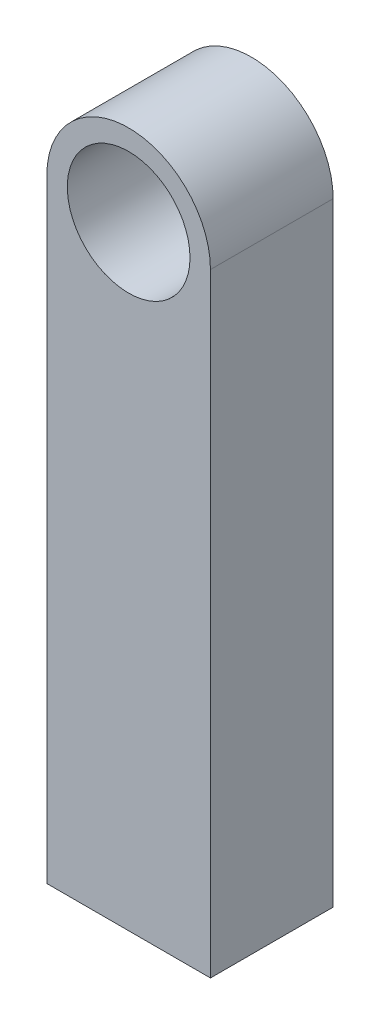
ISO-10303-21;
HEADER;
FILE_DESCRIPTION(('STEP AP214'),'2;1');
FILE_NAME('part.step','',(''),(''),'','','');
FILE_SCHEMA(('AUTOMOTIVE_DESIGN { 1 0 10303 214 1 1 1 1 }'));
ENDSEC;
DATA;
#1=APPLICATION_CONTEXT('core data for automotive mechanical design processes');
#2=APPLICATION_PROTOCOL_DEFINITION('international standard','automotive_design',2000,#1);
#3=PRODUCT_CONTEXT('',#1,'mechanical');
#4=PRODUCT('Part','Part','',(#3));
#5=PRODUCT_RELATED_PRODUCT_CATEGORY('part','',(#4));
#6=PRODUCT_DEFINITION_FORMATION('','',#4);
#7=PRODUCT_DEFINITION_CONTEXT('part definition',#1,'design');
#8=PRODUCT_DEFINITION('design','',#6,#7);
#9=PRODUCT_DEFINITION_SHAPE('','',#8);
#10=(LENGTH_UNIT() NAMED_UNIT(*) SI_UNIT(.MILLI.,.METRE.));
#11=(NAMED_UNIT(*) PLANE_ANGLE_UNIT() SI_UNIT($,.RADIAN.));
#12=(NAMED_UNIT(*) SI_UNIT($,.STERADIAN.) SOLID_ANGLE_UNIT());
#13=UNCERTAINTY_MEASURE_WITH_UNIT(LENGTH_MEASURE(1.E-05),#10,'distance_accuracy_value','');
#14=(GEOMETRIC_REPRESENTATION_CONTEXT(3) GLOBAL_UNCERTAINTY_ASSIGNED_CONTEXT((#13)) GLOBAL_UNIT_ASSIGNED_CONTEXT((#10,
#11,#12)) REPRESENTATION_CONTEXT('',''));
#15=CARTESIAN_POINT('',(0.,0.,0.));
#16=DIRECTION('',(0.,0.,1.));
#17=DIRECTION('',(1.,0.,0.));
#18=AXIS2_PLACEMENT_3D('',#15,#16,#17);
#19=CARTESIAN_POINT('',(2.,0.,3.));
#20=DIRECTION('',(1.,0.,0.));
#21=DIRECTION('',(0.,1.,0.));
#22=AXIS2_PLACEMENT_3D('',#19,#20,#21);
#23=PLANE('',#22);
#24=DIRECTION('',(0.,-1.,0.));
#25=VECTOR('',#24,1.);
#26=CARTESIAN_POINT('',(2.,0.,0.));
#27=LINE('',#26,#25);
#28=CARTESIAN_POINT('',(2.,0.,0.));
#29=VERTEX_POINT('',#28);
#30=CARTESIAN_POINT('',(2.,-15.,0.));
#31=VERTEX_POINT('',#30);
#32=EDGE_CURVE('E143',#29,#31,#27,.T.);
#33=ORIENTED_EDGE('',*,*,#32,.F.);
#34=DIRECTION('',(0.,0.,-1.));
#35=VECTOR('',#34,1.);
#36=CARTESIAN_POINT('',(2.,0.,3.));
#37=LINE('',#36,#35);
#38=CARTESIAN_POINT('',(2.,0.,3.));
#39=VERTEX_POINT('',#38);
#40=EDGE_CURVE('E11',#39,#29,#37,.T.);
#41=ORIENTED_EDGE('',*,*,#40,.F.);
#42=DIRECTION('',(0.,-1.,0.));
#43=VECTOR('',#42,1.);
#44=CARTESIAN_POINT('',(2.,0.,3.));
#45=LINE('',#44,#43);
#46=CARTESIAN_POINT('',(2.,-15.,3.));
#47=VERTEX_POINT('',#46);
#48=EDGE_CURVE('E147',#39,#47,#45,.T.);
#49=ORIENTED_EDGE('',*,*,#48,.T.);
#50=DIRECTION('',(0.,0.,-1.));
#51=VECTOR('',#50,1.);
#52=CARTESIAN_POINT('',(2.,-15.,3.));
#53=LINE('',#52,#51);
#54=EDGE_CURVE('E81',#47,#31,#53,.T.);
#55=ORIENTED_EDGE('',*,*,#54,.T.);
#56=EDGE_LOOP('',(#33,#41,#49,#55));
#57=FACE_BOUND('',#56,.T.);
#58=ADVANCED_FACE('F38',(#57),#23,.T.);
#59=CARTESIAN_POINT('',(0.,0.,3.));
#60=DIRECTION('',(0.,0.,-1.));
#61=DIRECTION('',(-1.,0.,0.));
#62=AXIS2_PLACEMENT_3D('',#59,#60,#61);
#63=CYLINDRICAL_SURFACE('',#62,2.);
#64=CARTESIAN_POINT('',(0.,0.,0.));
#65=DIRECTION('',(0.,0.,1.));
#66=DIRECTION('',(1.,0.,0.));
#67=AXIS2_PLACEMENT_3D('',#64,#65,#66);
#68=CIRCLE('',#67,2.);
#69=CARTESIAN_POINT('',(-2.,0.,0.));
#70=VERTEX_POINT('',#69);
#71=EDGE_CURVE('E160',#29,#70,#68,.T.);
#72=ORIENTED_EDGE('',*,*,#71,.T.);
#73=DIRECTION('',(0.,0.,-1.));
#74=VECTOR('',#73,1.);
#75=CARTESIAN_POINT('',(-2.,0.,3.));
#76=LINE('',#75,#74);
#77=CARTESIAN_POINT('',(-2.,0.,3.));
#78=VERTEX_POINT('',#77);
#79=EDGE_CURVE('E45',#78,#70,#76,.T.);
#80=ORIENTED_EDGE('',*,*,#79,.F.);
#81=CARTESIAN_POINT('',(0.,0.,3.));
#82=DIRECTION('',(0.,0.,1.));
#83=DIRECTION('',(1.,0.,0.));
#84=AXIS2_PLACEMENT_3D('',#81,#82,#83);
#85=CIRCLE('',#84,2.);
#86=EDGE_CURVE('E149',#39,#78,#85,.T.);
#87=ORIENTED_EDGE('',*,*,#86,.F.);
#88=ORIENTED_EDGE('',*,*,#40,.T.);
#89=EDGE_LOOP('',(#72,#80,#87,#88));
#90=FACE_BOUND('',#89,.T.);
#91=ADVANCED_FACE('F188',(#90),#63,.T.);
#92=CARTESIAN_POINT('',(-2.,0.,3.));
#93=DIRECTION('',(1.,0.,0.));
#94=DIRECTION('',(0.,1.,0.));
#95=AXIS2_PLACEMENT_3D('',#92,#93,#94);
#96=PLANE('',#95);
#97=DIRECTION('',(0.,-1.,0.));
#98=VECTOR('',#97,1.);
#99=CARTESIAN_POINT('',(-2.,0.,0.));
#100=LINE('',#99,#98);
#101=CARTESIAN_POINT('',(-2.,-15.,0.));
#102=VERTEX_POINT('',#101);
#103=EDGE_CURVE('E162',#70,#102,#100,.T.);
#104=ORIENTED_EDGE('',*,*,#103,.T.);
#105=DIRECTION('',(0.,0.,-1.));
#106=VECTOR('',#105,1.);
#107=CARTESIAN_POINT('',(-2.,-15.,3.));
#108=LINE('',#107,#106);
#109=CARTESIAN_POINT('',(-2.,-15.,3.));
#110=VERTEX_POINT('',#109);
#111=EDGE_CURVE('E169',#110,#102,#108,.T.);
#112=ORIENTED_EDGE('',*,*,#111,.F.);
#113=DIRECTION('',(0.,-1.,0.));
#114=VECTOR('',#113,1.);
#115=CARTESIAN_POINT('',(-2.,0.,3.));
#116=LINE('',#115,#114);
#117=EDGE_CURVE('E152',#78,#110,#116,.T.);
#118=ORIENTED_EDGE('',*,*,#117,.F.);
#119=ORIENTED_EDGE('',*,*,#79,.T.);
#120=EDGE_LOOP('',(#104,#112,#118,#119));
#121=FACE_BOUND('',#120,.T.);
#122=ADVANCED_FACE('F176',(#121),#96,.F.);
#123=CARTESIAN_POINT('',(0.,-15.,3.));
#124=DIRECTION('',(0.,1.,0.));
#125=DIRECTION('',(0.,0.,1.));
#126=AXIS2_PLACEMENT_3D('',#123,#124,#125);
#127=PLANE('',#126);
#128=DIRECTION('',(1.,0.,0.));
#129=VECTOR('',#128,1.);
#130=CARTESIAN_POINT('',(-1.5,-15.,0.5));
#131=LINE('',#130,#129);
#132=CARTESIAN_POINT('',(-1.5,-15.,0.5));
#133=VERTEX_POINT('',#132);
#134=CARTESIAN_POINT('',(1.5,-15.,0.5));
#135=VERTEX_POINT('',#134);
#136=EDGE_CURVE('E137',#133,#135,#131,.T.);
#137=ORIENTED_EDGE('',*,*,#136,.F.);
#138=DIRECTION('',(0.,0.,-1.));
#139=VECTOR('',#138,1.);
#140=CARTESIAN_POINT('',(-1.5,-15.,0.5));
#141=LINE('',#140,#139);
#142=CARTESIAN_POINT('',(-1.5,-15.,2.5));
#143=VERTEX_POINT('',#142);
#144=EDGE_CURVE('E52',#143,#133,#141,.T.);
#145=ORIENTED_EDGE('',*,*,#144,.F.);
#146=DIRECTION('',(-1.,0.,0.));
#147=VECTOR('',#146,1.);
#148=CARTESIAN_POINT('',(-1.5,-15.,2.5));
#149=LINE('',#148,#147);
#150=CARTESIAN_POINT('',(1.5,-15.,2.5));
#151=VERTEX_POINT('',#150);
#152=EDGE_CURVE('E128',#151,#143,#149,.T.);
#153=ORIENTED_EDGE('',*,*,#152,.F.);
#154=DIRECTION('',(0.,0.,1.));
#155=VECTOR('',#154,1.);
#156=CARTESIAN_POINT('',(1.5,-15.,0.5));
#157=LINE('',#156,#155);
#158=EDGE_CURVE('E131',#135,#151,#157,.T.);
#159=ORIENTED_EDGE('',*,*,#158,.F.);
#160=EDGE_LOOP('',(#137,#145,#153,#159));
#161=FACE_BOUND('',#160,.T.);
#162=DIRECTION('',(1.,0.,0.));
#163=VECTOR('',#162,1.);
#164=CARTESIAN_POINT('',(0.,-15.,0.));
#165=LINE('',#164,#163);
#166=EDGE_CURVE('E164',#102,#31,#165,.T.);
#167=ORIENTED_EDGE('',*,*,#166,.T.);
#168=ORIENTED_EDGE('',*,*,#54,.F.);
#169=DIRECTION('',(1.,0.,0.));
#170=VECTOR('',#169,1.);
#171=CARTESIAN_POINT('',(0.,-15.,3.));
#172=LINE('',#171,#170);
#173=EDGE_CURVE('E61',#110,#47,#172,.T.);
#174=ORIENTED_EDGE('',*,*,#173,.F.);
#175=ORIENTED_EDGE('',*,*,#111,.T.);
#176=EDGE_LOOP('',(#167,#168,#174,#175));
#177=FACE_BOUND('',#176,.T.);
#178=ADVANCED_FACE('F185',(#161,#177),#127,.F.);
#179=CARTESIAN_POINT('',(0.,0.,3.));
#180=DIRECTION('',(0.,0.,-1.));
#181=DIRECTION('',(-1.,0.,0.));
#182=AXIS2_PLACEMENT_3D('',#179,#180,#181);
#183=CYLINDRICAL_SURFACE('',#182,1.5);
#184=CARTESIAN_POINT('',(0.,0.,3.));
#185=DIRECTION('',(0.,0.,1.));
#186=DIRECTION('',(1.,0.,0.));
#187=AXIS2_PLACEMENT_3D('',#184,#185,#186);
#188=CIRCLE('',#187,1.5);
#189=CARTESIAN_POINT('',(1.5,0.,3.));
#190=VERTEX_POINT('',#189);
#191=EDGE_CURVE('E155',#190,#190,#188,.T.);
#192=ORIENTED_EDGE('',*,*,#191,.T.);
#193=EDGE_LOOP('',(#192));
#194=FACE_BOUND('',#193,.T.);
#195=CARTESIAN_POINT('',(0.,0.,0.));
#196=DIRECTION('',(0.,0.,1.));
#197=DIRECTION('',(1.,0.,0.));
#198=AXIS2_PLACEMENT_3D('',#195,#196,#197);
#199=CIRCLE('',#198,1.5);
#200=CARTESIAN_POINT('',(1.5,0.,0.));
#201=VERTEX_POINT('',#200);
#202=EDGE_CURVE('E150',#201,#201,#199,.T.);
#203=ORIENTED_EDGE('',*,*,#202,.F.);
#204=EDGE_LOOP('',(#203));
#205=FACE_BOUND('',#204,.T.);
#206=ADVANCED_FACE('F198',(#194,#205),#183,.F.);
#207=CARTESIAN_POINT('',(0.,0.,3.));
#208=DIRECTION('',(0.,0.,1.));
#209=DIRECTION('',(1.,0.,0.));
#210=AXIS2_PLACEMENT_3D('',#207,#208,#209);
#211=PLANE('',#210);
#212=ORIENTED_EDGE('',*,*,#48,.F.);
#213=ORIENTED_EDGE('',*,*,#86,.T.);
#214=ORIENTED_EDGE('',*,*,#117,.T.);
#215=ORIENTED_EDGE('',*,*,#173,.T.);
#216=EDGE_LOOP('',(#212,#213,#214,#215));
#217=FACE_BOUND('',#216,.T.);
#218=ORIENTED_EDGE('',*,*,#191,.F.);
#219=EDGE_LOOP('',(#218));
#220=FACE_BOUND('',#219,.T.);
#221=ADVANCED_FACE('F186',(#217,#220),#211,.T.);
#222=CARTESIAN_POINT('',(0.,0.,0.));
#223=DIRECTION('',(0.,0.,1.));
#224=DIRECTION('',(1.,0.,0.));
#225=AXIS2_PLACEMENT_3D('',#222,#223,#224);
#226=PLANE('',#225);
#227=ORIENTED_EDGE('',*,*,#32,.T.);
#228=ORIENTED_EDGE('',*,*,#166,.F.);
#229=ORIENTED_EDGE('',*,*,#103,.F.);
#230=ORIENTED_EDGE('',*,*,#71,.F.);
#231=EDGE_LOOP('',(#227,#228,#229,#230));
#232=FACE_BOUND('',#231,.T.);
#233=ORIENTED_EDGE('',*,*,#202,.T.);
#234=EDGE_LOOP('',(#233));
#235=FACE_BOUND('',#234,.T.);
#236=ADVANCED_FACE('F182',(#232,#235),#226,.F.);
#237=CARTESIAN_POINT('',(-1.5,-5.,0.5));
#238=DIRECTION('',(-1.,0.,0.));
#239=DIRECTION('',(0.,0.,1.));
#240=AXIS2_PLACEMENT_3D('',#237,#238,#239);
#241=PLANE('',#240);
#242=ORIENTED_EDGE('',*,*,#144,.T.);
#243=DIRECTION('',(0.,-1.,0.));
#244=VECTOR('',#243,1.);
#245=CARTESIAN_POINT('',(-1.5,-5.,0.5));
#246=LINE('',#245,#244);
#247=CARTESIAN_POINT('',(-1.5,-5.,0.5));
#248=VERTEX_POINT('',#247);
#249=EDGE_CURVE('E106',#248,#133,#246,.T.);
#250=ORIENTED_EDGE('',*,*,#249,.F.);
#251=DIRECTION('',(0.,0.,-1.));
#252=VECTOR('',#251,1.);
#253=CARTESIAN_POINT('',(-1.5,-5.,0.5));
#254=LINE('',#253,#252);
#255=CARTESIAN_POINT('',(-1.5,-5.,2.5));
#256=VERTEX_POINT('',#255);
#257=EDGE_CURVE('E110',#256,#248,#254,.T.);
#258=ORIENTED_EDGE('',*,*,#257,.F.);
#259=DIRECTION('',(0.,-1.,0.));
#260=VECTOR('',#259,1.);
#261=CARTESIAN_POINT('',(-1.5,-5.,2.5));
#262=LINE('',#261,#260);
#263=EDGE_CURVE('E141',#256,#143,#262,.T.);
#264=ORIENTED_EDGE('',*,*,#263,.T.);
#265=EDGE_LOOP('',(#242,#250,#258,#264));
#266=FACE_BOUND('',#265,.T.);
#267=ADVANCED_FACE('F108',(#266),#241,.F.);
#268=CARTESIAN_POINT('',(-1.5,-5.,2.5));
#269=DIRECTION('',(0.,0.,1.));
#270=DIRECTION('',(1.,0.,0.));
#271=AXIS2_PLACEMENT_3D('',#268,#269,#270);
#272=PLANE('',#271);
#273=ORIENTED_EDGE('',*,*,#152,.T.);
#274=ORIENTED_EDGE('',*,*,#263,.F.);
#275=DIRECTION('',(-1.,0.,0.));
#276=VECTOR('',#275,1.);
#277=CARTESIAN_POINT('',(-1.5,-5.,2.5));
#278=LINE('',#277,#276);
#279=CARTESIAN_POINT('',(1.5,-5.,2.5));
#280=VERTEX_POINT('',#279);
#281=EDGE_CURVE('E116',#280,#256,#278,.T.);
#282=ORIENTED_EDGE('',*,*,#281,.F.);
#283=DIRECTION('',(0.,-1.,0.));
#284=VECTOR('',#283,1.);
#285=CARTESIAN_POINT('',(1.5,-5.,2.5));
#286=LINE('',#285,#284);
#287=EDGE_CURVE('E144',#280,#151,#286,.T.);
#288=ORIENTED_EDGE('',*,*,#287,.T.);
#289=EDGE_LOOP('',(#273,#274,#282,#288));
#290=FACE_BOUND('',#289,.T.);
#291=ADVANCED_FACE('F209',(#290),#272,.F.);
#292=CARTESIAN_POINT('',(1.5,-5.,0.5));
#293=DIRECTION('',(1.,0.,0.));
#294=DIRECTION('',(0.,0.,-1.));
#295=AXIS2_PLACEMENT_3D('',#292,#293,#294);
#296=PLANE('',#295);
#297=ORIENTED_EDGE('',*,*,#158,.T.);
#298=ORIENTED_EDGE('',*,*,#287,.F.);
#299=DIRECTION('',(0.,0.,1.));
#300=VECTOR('',#299,1.);
#301=CARTESIAN_POINT('',(1.5,-5.,0.5));
#302=LINE('',#301,#300);
#303=CARTESIAN_POINT('',(1.5,-5.,0.5));
#304=VERTEX_POINT('',#303);
#305=EDGE_CURVE('E124',#304,#280,#302,.T.);
#306=ORIENTED_EDGE('',*,*,#305,.F.);
#307=DIRECTION('',(0.,-1.,0.));
#308=VECTOR('',#307,1.);
#309=CARTESIAN_POINT('',(1.5,-5.,0.5));
#310=LINE('',#309,#308);
#311=EDGE_CURVE('E115',#304,#135,#310,.T.);
#312=ORIENTED_EDGE('',*,*,#311,.T.);
#313=EDGE_LOOP('',(#297,#298,#306,#312));
#314=FACE_BOUND('',#313,.T.);
#315=ADVANCED_FACE('F212',(#314),#296,.F.);
#316=CARTESIAN_POINT('',(-1.5,-5.,0.5));
#317=DIRECTION('',(0.,0.,-1.));
#318=DIRECTION('',(-1.,0.,0.));
#319=AXIS2_PLACEMENT_3D('',#316,#317,#318);
#320=PLANE('',#319);
#321=ORIENTED_EDGE('',*,*,#136,.T.);
#322=ORIENTED_EDGE('',*,*,#311,.F.);
#323=DIRECTION('',(1.,0.,0.));
#324=VECTOR('',#323,1.);
#325=CARTESIAN_POINT('',(-1.5,-5.,0.5));
#326=LINE('',#325,#324);
#327=EDGE_CURVE('E119',#248,#304,#326,.T.);
#328=ORIENTED_EDGE('',*,*,#327,.F.);
#329=ORIENTED_EDGE('',*,*,#249,.T.);
#330=EDGE_LOOP('',(#321,#322,#328,#329));
#331=FACE_BOUND('',#330,.T.);
#332=ADVANCED_FACE('F120',(#331),#320,.F.);
#333=CARTESIAN_POINT('',(0.,-5.,0.));
#334=DIRECTION('',(0.,1.,0.));
#335=DIRECTION('',(0.,0.,1.));
#336=AXIS2_PLACEMENT_3D('',#333,#334,#335);
#337=PLANE('',#336);
#338=ORIENTED_EDGE('',*,*,#257,.T.);
#339=ORIENTED_EDGE('',*,*,#327,.T.);
#340=ORIENTED_EDGE('',*,*,#305,.T.);
#341=ORIENTED_EDGE('',*,*,#281,.T.);
#342=EDGE_LOOP('',(#338,#339,#340,#341));
#343=FACE_BOUND('',#342,.T.);
#344=ADVANCED_FACE('F126',(#343),#337,.F.);
#345=CLOSED_SHELL('',(#58,#91,#122,#178,#206,#221,#236,#267,#291,#315,#332,#344));
#346=MANIFOLD_SOLID_BREP('B2',#345);
#347=ADVANCED_BREP_SHAPE_REPRESENTATION('',(#18,#346),#14);
#348=SHAPE_DEFINITION_REPRESENTATION(#9,#347);
ENDSEC;
END-ISO-10303-21;
